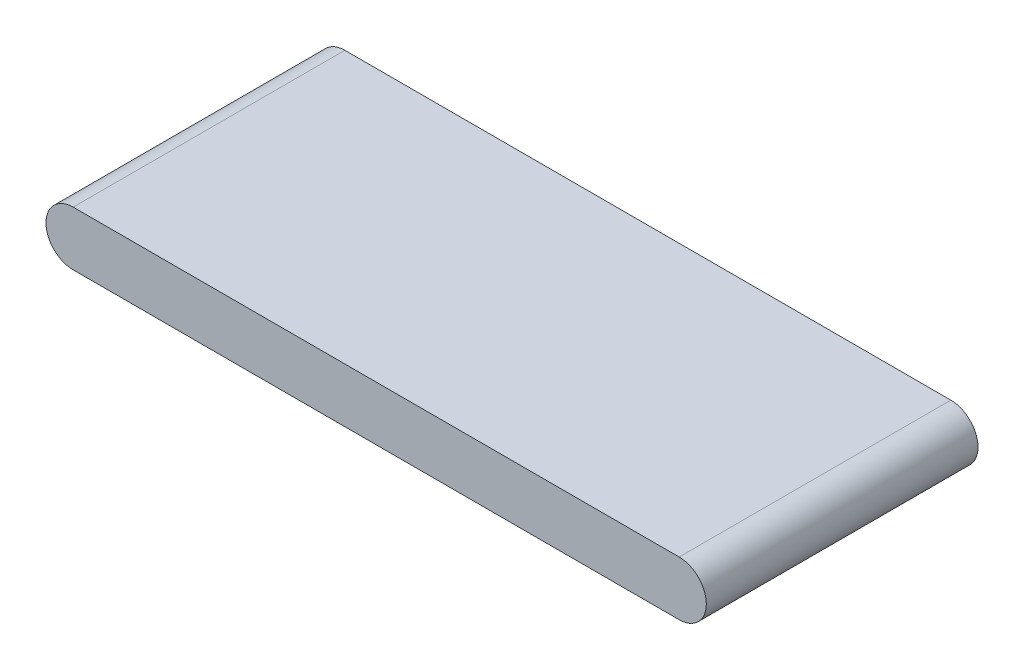
ISO-10303-21;
HEADER;
FILE_DESCRIPTION(('STEP AP214'),'2;1');
FILE_NAME('part.step','',(''),(''),'','','');
FILE_SCHEMA(('AUTOMOTIVE_DESIGN { 1 0 10303 214 1 1 1 1 }'));
ENDSEC;
DATA;
#1=APPLICATION_CONTEXT('core data for automotive mechanical design processes');
#2=APPLICATION_PROTOCOL_DEFINITION('international standard','automotive_design',2000,#1);
#3=PRODUCT_CONTEXT('',#1,'mechanical');
#4=PRODUCT('Part','Part','',(#3));
#5=PRODUCT_RELATED_PRODUCT_CATEGORY('part','',(#4));
#6=PRODUCT_DEFINITION_FORMATION('','',#4);
#7=PRODUCT_DEFINITION_CONTEXT('part definition',#1,'design');
#8=PRODUCT_DEFINITION('design','',#6,#7);
#9=PRODUCT_DEFINITION_SHAPE('','',#8);
#10=(LENGTH_UNIT() NAMED_UNIT(*) SI_UNIT(.MILLI.,.METRE.));
#11=(NAMED_UNIT(*) PLANE_ANGLE_UNIT() SI_UNIT($,.RADIAN.));
#12=(NAMED_UNIT(*) SI_UNIT($,.STERADIAN.) SOLID_ANGLE_UNIT());
#13=UNCERTAINTY_MEASURE_WITH_UNIT(LENGTH_MEASURE(1.E-05),#10,'distance_accuracy_value','');
#14=(GEOMETRIC_REPRESENTATION_CONTEXT(3) GLOBAL_UNCERTAINTY_ASSIGNED_CONTEXT((#13)) GLOBAL_UNIT_ASSIGNED_CONTEXT((#10,
#11,#12)) REPRESENTATION_CONTEXT('',''));
#15=CARTESIAN_POINT('',(0.,0.,0.));
#16=DIRECTION('',(0.,0.,1.));
#17=DIRECTION('',(1.,0.,0.));
#18=AXIS2_PLACEMENT_3D('',#15,#16,#17);
#19=CARTESIAN_POINT('',(401.5,399.,53.));
#20=DIRECTION('',(0.,0.,-1.));
#21=DIRECTION('',(0.,-1.,0.));
#22=AXIS2_PLACEMENT_3D('',#19,#20,#21);
#23=PLANE('',#22);
#24=CARTESIAN_POINT('',(602.25,417.,53.));
#25=DIRECTION('',(-1.,0.,0.));
#26=VECTOR('',#25,1.);
#27=LINE('',#24,#26);
#28=CARTESIAN_POINT('',(602.25,417.,53.));
#29=VERTEX_POINT('',#28);
#30=CARTESIAN_POINT('',(200.75,417.,53.));
#31=VERTEX_POINT('',#30);
#32=EDGE_CURVE('E75',#29,#31,#27,.T.);
#33=ORIENTED_EDGE('',*,*,#32,.F.);
#34=CARTESIAN_POINT('',(602.25,399.,53.));
#35=DIRECTION('',(0.,0.,1.));
#36=DIRECTION('',(0.,-1.,0.));
#37=AXIS2_PLACEMENT_3D('',#34,#35,#36);
#38=CIRCLE('',#37,18.);
#39=CARTESIAN_POINT('',(602.25,381.,53.));
#40=VERTEX_POINT('',#39);
#41=EDGE_CURVE('E58',#40,#29,#38,.T.);
#42=ORIENTED_EDGE('',*,*,#41,.F.);
#43=CARTESIAN_POINT('',(200.75,381.,53.));
#44=DIRECTION('',(1.,0.,0.));
#45=VECTOR('',#44,1.);
#46=LINE('',#43,#45);
#47=CARTESIAN_POINT('',(200.75,381.,53.));
#48=VERTEX_POINT('',#47);
#49=EDGE_CURVE('E71',#48,#40,#46,.T.);
#50=ORIENTED_EDGE('',*,*,#49,.F.);
#51=CARTESIAN_POINT('',(200.75,399.,53.));
#52=DIRECTION('',(0.,0.,1.));
#53=DIRECTION('',(0.,1.,0.));
#54=AXIS2_PLACEMENT_3D('',#51,#52,#53);
#55=CIRCLE('',#54,18.);
#56=EDGE_CURVE('E78',#31,#48,#55,.T.);
#57=ORIENTED_EDGE('',*,*,#56,.F.);
#58=EDGE_LOOP('',(#33,#42,#50,#57));
#59=FACE_BOUND('',#58,.T.);
#60=ADVANCED_FACE('F17',(#59),#23,.T.);
#61=CARTESIAN_POINT('',(602.25,399.,233.));
#62=DIRECTION('',(0.,0.,-1.));
#63=DIRECTION('',(-1.,0.,0.));
#64=AXIS2_PLACEMENT_3D('',#61,#62,#63);
#65=CYLINDRICAL_SURFACE('',#64,18.);
#66=CARTESIAN_POINT('',(602.25,417.,233.));
#67=DIRECTION('',(0.,0.,-1.));
#68=VECTOR('',#67,1.);
#69=LINE('',#66,#68);
#70=CARTESIAN_POINT('',(602.25,417.,233.));
#71=VERTEX_POINT('',#70);
#72=EDGE_CURVE('E63',#71,#29,#69,.T.);
#73=ORIENTED_EDGE('',*,*,#72,.F.);
#74=CARTESIAN_POINT('',(602.25,399.,233.));
#75=DIRECTION('',(0.,0.,-1.));
#76=DIRECTION('',(0.,1.,0.));
#77=AXIS2_PLACEMENT_3D('',#74,#75,#76);
#78=CIRCLE('',#77,18.);
#79=CARTESIAN_POINT('',(602.25,381.,233.));
#80=VERTEX_POINT('',#79);
#81=EDGE_CURVE('E225',#71,#80,#78,.T.);
#82=ORIENTED_EDGE('',*,*,#81,.T.);
#83=CARTESIAN_POINT('',(602.25,381.,53.));
#84=DIRECTION('',(0.,0.,1.));
#85=VECTOR('',#84,1.);
#86=LINE('',#83,#85);
#87=EDGE_CURVE('E66',#40,#80,#86,.T.);
#88=ORIENTED_EDGE('',*,*,#87,.F.);
#89=ORIENTED_EDGE('',*,*,#41,.T.);
#90=EDGE_LOOP('',(#73,#82,#88,#89));
#91=FACE_BOUND('',#90,.T.);
#92=ADVANCED_FACE('F61',(#91),#65,.T.);
#93=CARTESIAN_POINT('',(602.25,381.,233.));
#94=DIRECTION('',(0.,-1.,0.));
#95=DIRECTION('',(0.,0.,-1.));
#96=AXIS2_PLACEMENT_3D('',#93,#94,#95);
#97=PLANE('',#96);
#98=ORIENTED_EDGE('',*,*,#87,.T.);
#99=CARTESIAN_POINT('',(602.25,381.,233.));
#100=DIRECTION('',(-1.,0.,0.));
#101=VECTOR('',#100,1.);
#102=LINE('',#99,#101);
#103=CARTESIAN_POINT('',(200.75,381.,233.));
#104=VERTEX_POINT('',#103);
#105=EDGE_CURVE('E207',#80,#104,#102,.T.);
#106=ORIENTED_EDGE('',*,*,#105,.T.);
#107=CARTESIAN_POINT('',(200.75,381.,53.));
#108=DIRECTION('',(0.,0.,1.));
#109=VECTOR('',#108,1.);
#110=LINE('',#107,#109);
#111=EDGE_CURVE('E92',#48,#104,#110,.T.);
#112=ORIENTED_EDGE('',*,*,#111,.F.);
#113=ORIENTED_EDGE('',*,*,#49,.T.);
#114=EDGE_LOOP('',(#98,#106,#112,#113));
#115=FACE_BOUND('',#114,.T.);
#116=ADVANCED_FACE('F181',(#115),#97,.T.);
#117=CARTESIAN_POINT('',(200.75,399.,233.));
#118=DIRECTION('',(0.,0.,-1.));
#119=DIRECTION('',(-1.,0.,0.));
#120=AXIS2_PLACEMENT_3D('',#117,#118,#119);
#121=CYLINDRICAL_SURFACE('',#120,18.);
#122=ORIENTED_EDGE('',*,*,#111,.T.);
#123=CARTESIAN_POINT('',(200.75,399.,233.));
#124=DIRECTION('',(0.,0.,-1.));
#125=DIRECTION('',(0.,-1.,0.));
#126=AXIS2_PLACEMENT_3D('',#123,#124,#125);
#127=CIRCLE('',#126,18.);
#128=CARTESIAN_POINT('',(200.75,417.,233.));
#129=VERTEX_POINT('',#128);
#130=EDGE_CURVE('E29',#104,#129,#127,.T.);
#131=ORIENTED_EDGE('',*,*,#130,.T.);
#132=CARTESIAN_POINT('',(200.75,417.,53.));
#133=DIRECTION('',(0.,0.,1.));
#134=VECTOR('',#133,1.);
#135=LINE('',#132,#134);
#136=EDGE_CURVE('E83',#31,#129,#135,.T.);
#137=ORIENTED_EDGE('',*,*,#136,.F.);
#138=ORIENTED_EDGE('',*,*,#56,.T.);
#139=EDGE_LOOP('',(#122,#131,#137,#138));
#140=FACE_BOUND('',#139,.T.);
#141=ADVANCED_FACE('F112',(#140),#121,.T.);
#142=CARTESIAN_POINT('',(200.75,417.,233.));
#143=DIRECTION('',(0.,1.,0.));
#144=DIRECTION('',(1.,0.,0.));
#145=AXIS2_PLACEMENT_3D('',#142,#143,#144);
#146=PLANE('',#145);
#147=ORIENTED_EDGE('',*,*,#136,.T.);
#148=CARTESIAN_POINT('',(200.75,417.,233.));
#149=DIRECTION('',(1.,0.,0.));
#150=VECTOR('',#149,1.);
#151=LINE('',#148,#150);
#152=EDGE_CURVE('E11',#129,#71,#151,.T.);
#153=ORIENTED_EDGE('',*,*,#152,.T.);
#154=ORIENTED_EDGE('',*,*,#72,.T.);
#155=ORIENTED_EDGE('',*,*,#32,.T.);
#156=EDGE_LOOP('',(#147,#153,#154,#155));
#157=FACE_BOUND('',#156,.T.);
#158=ADVANCED_FACE('F87',(#157),#146,.T.);
#159=CARTESIAN_POINT('',(401.5,399.,233.));
#160=DIRECTION('',(0.,0.,-1.));
#161=DIRECTION('',(0.,-1.,0.));
#162=AXIS2_PLACEMENT_3D('',#159,#160,#161);
#163=PLANE('',#162);
#164=ORIENTED_EDGE('',*,*,#130,.F.);
#165=ORIENTED_EDGE('',*,*,#105,.F.);
#166=ORIENTED_EDGE('',*,*,#81,.F.);
#167=ORIENTED_EDGE('',*,*,#152,.F.);
#168=EDGE_LOOP('',(#164,#165,#166,#167));
#169=FACE_BOUND('',#168,.T.);
#170=ADVANCED_FACE('F111',(#169),#163,.F.);
#171=CLOSED_SHELL('',(#60,#92,#116,#141,#158,#170));
#172=MANIFOLD_SOLID_BREP('B1',#171);
#173=ADVANCED_BREP_SHAPE_REPRESENTATION('',(#18,#172),#14);
#174=SHAPE_DEFINITION_REPRESENTATION(#9,#173);
ENDSEC;
END-ISO-10303-21;
